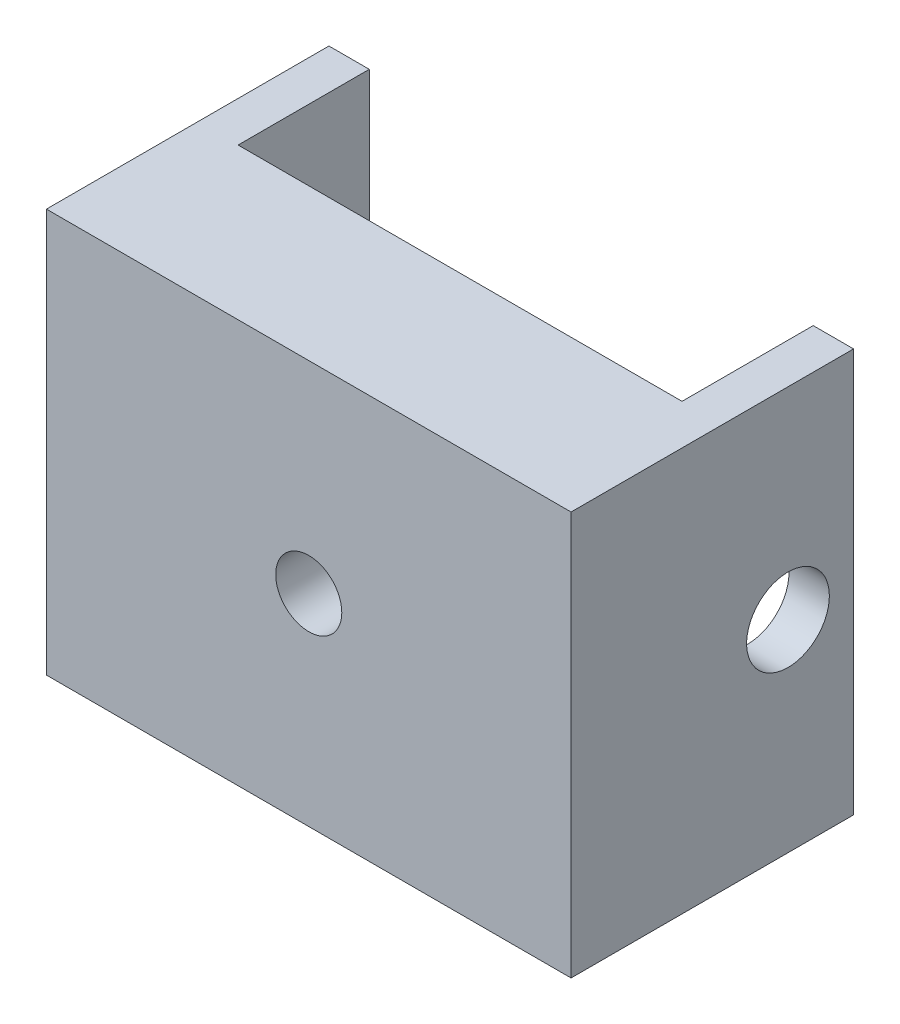
ISO-10303-21;
HEADER;
FILE_DESCRIPTION(('STEP AP214'),'2;1');
FILE_NAME('part.step','',(''),(''),'','','');
FILE_SCHEMA(('AUTOMOTIVE_DESIGN { 1 0 10303 214 1 1 1 1 }'));
ENDSEC;
DATA;
#1=APPLICATION_CONTEXT('core data for automotive mechanical design processes');
#2=APPLICATION_PROTOCOL_DEFINITION('international standard','automotive_design',2000,#1);
#3=PRODUCT_CONTEXT('',#1,'mechanical');
#4=PRODUCT('Part','Part','',(#3));
#5=PRODUCT_RELATED_PRODUCT_CATEGORY('part','',(#4));
#6=PRODUCT_DEFINITION_FORMATION('','',#4);
#7=PRODUCT_DEFINITION_CONTEXT('part definition',#1,'design');
#8=PRODUCT_DEFINITION('design','',#6,#7);
#9=PRODUCT_DEFINITION_SHAPE('','',#8);
#10=(LENGTH_UNIT() NAMED_UNIT(*) SI_UNIT(.MILLI.,.METRE.));
#11=(NAMED_UNIT(*) PLANE_ANGLE_UNIT() SI_UNIT($,.RADIAN.));
#12=(NAMED_UNIT(*) SI_UNIT($,.STERADIAN.) SOLID_ANGLE_UNIT());
#13=UNCERTAINTY_MEASURE_WITH_UNIT(LENGTH_MEASURE(1.E-05),#10,'distance_accuracy_value','');
#14=(GEOMETRIC_REPRESENTATION_CONTEXT(3) GLOBAL_UNCERTAINTY_ASSIGNED_CONTEXT((#13)) GLOBAL_UNIT_ASSIGNED_CONTEXT((#10,
#11,#12)) REPRESENTATION_CONTEXT('',''));
#15=CARTESIAN_POINT('',(0.,0.,0.));
#16=DIRECTION('',(0.,0.,1.));
#17=DIRECTION('',(1.,0.,0.));
#18=AXIS2_PLACEMENT_3D('',#15,#16,#17);
#19=CARTESIAN_POINT('',(0.,20.,-2.5));
#20=DIRECTION('',(0.,0.,-1.));
#21=DIRECTION('',(-1.,0.,0.));
#22=AXIS2_PLACEMENT_3D('',#19,#20,#21);
#23=PLANE('',#22);
#24=CARTESIAN_POINT('',(0.,10.,-2.5));
#25=DIRECTION('',(0.,0.,-1.));
#26=DIRECTION('',(-1.,0.,0.));
#27=AXIS2_PLACEMENT_3D('',#24,#25,#26);
#28=CIRCLE('',#27,1.6375);
#29=CARTESIAN_POINT('',(-1.6375,10.,-2.5));
#30=VERTEX_POINT('',#29);
#31=EDGE_CURVE('E147',#30,#30,#28,.T.);
#32=ORIENTED_EDGE('',*,*,#31,.F.);
#33=EDGE_LOOP('',(#32));
#34=FACE_BOUND('',#33,.T.);
#35=DIRECTION('',(1.,0.,0.));
#36=VECTOR('',#35,1.);
#37=CARTESIAN_POINT('',(0.,0.,-2.5));
#38=LINE('',#37,#36);
#39=CARTESIAN_POINT('',(-11.,0.,-2.5));
#40=VERTEX_POINT('',#39);
#41=CARTESIAN_POINT('',(11.,0.,-2.5));
#42=VERTEX_POINT('',#41);
#43=EDGE_CURVE('E143',#40,#42,#38,.T.);
#44=ORIENTED_EDGE('',*,*,#43,.F.);
#45=DIRECTION('',(0.,-1.,0.));
#46=VECTOR('',#45,1.);
#47=CARTESIAN_POINT('',(-11.,20.,-2.5));
#48=LINE('',#47,#46);
#49=CARTESIAN_POINT('',(-11.,20.,-2.5));
#50=VERTEX_POINT('',#49);
#51=EDGE_CURVE('E11',#50,#40,#48,.T.);
#52=ORIENTED_EDGE('',*,*,#51,.F.);
#53=DIRECTION('',(1.,0.,0.));
#54=VECTOR('',#53,1.);
#55=CARTESIAN_POINT('',(0.,20.,-2.5));
#56=LINE('',#55,#54);
#57=CARTESIAN_POINT('',(11.,20.,-2.5));
#58=VERTEX_POINT('',#57);
#59=EDGE_CURVE('E172',#50,#58,#56,.T.);
#60=ORIENTED_EDGE('',*,*,#59,.T.);
#61=DIRECTION('',(0.,-1.,0.));
#62=VECTOR('',#61,1.);
#63=CARTESIAN_POINT('',(11.,20.,-2.5));
#64=LINE('',#63,#62);
#65=EDGE_CURVE('E62',#58,#42,#64,.T.);
#66=ORIENTED_EDGE('',*,*,#65,.T.);
#67=EDGE_LOOP('',(#44,#52,#60,#66));
#68=FACE_BOUND('',#67,.T.);
#69=ADVANCED_FACE('F44',(#34,#68),#23,.T.);
#70=CARTESIAN_POINT('',(-11.,20.,0.));
#71=DIRECTION('',(1.,0.,0.));
#72=DIRECTION('',(0.,0.,-1.));
#73=AXIS2_PLACEMENT_3D('',#70,#71,#72);
#74=PLANE('',#73);
#75=CARTESIAN_POINT('',(-11.,10.,-5.75));
#76=DIRECTION('',(1.,0.,0.));
#77=DIRECTION('',(0.,0.,-1.));
#78=AXIS2_PLACEMENT_3D('',#75,#76,#77);
#79=CIRCLE('',#78,2.05);
#80=CARTESIAN_POINT('',(-11.,10.,-7.8));
#81=VERTEX_POINT('',#80);
#82=EDGE_CURVE('E242',#81,#81,#79,.T.);
#83=ORIENTED_EDGE('',*,*,#82,.F.);
#84=EDGE_LOOP('',(#83));
#85=FACE_BOUND('',#84,.T.);
#86=DIRECTION('',(0.,0.,1.));
#87=VECTOR('',#86,1.);
#88=CARTESIAN_POINT('',(-11.,0.,0.));
#89=LINE('',#88,#87);
#90=CARTESIAN_POINT('',(-11.,0.,-9.));
#91=VERTEX_POINT('',#90);
#92=EDGE_CURVE('E146',#91,#40,#89,.T.);
#93=ORIENTED_EDGE('',*,*,#92,.F.);
#94=DIRECTION('',(0.,-1.,0.));
#95=VECTOR('',#94,1.);
#96=CARTESIAN_POINT('',(-11.,20.,-9.));
#97=LINE('',#96,#95);
#98=CARTESIAN_POINT('',(-11.,20.,-9.));
#99=VERTEX_POINT('',#98);
#100=EDGE_CURVE('E54',#99,#91,#97,.T.);
#101=ORIENTED_EDGE('',*,*,#100,.F.);
#102=DIRECTION('',(0.,0.,1.));
#103=VECTOR('',#102,1.);
#104=CARTESIAN_POINT('',(-11.,20.,0.));
#105=LINE('',#104,#103);
#106=EDGE_CURVE('E205',#99,#50,#105,.T.);
#107=ORIENTED_EDGE('',*,*,#106,.T.);
#108=ORIENTED_EDGE('',*,*,#51,.T.);
#109=EDGE_LOOP('',(#93,#101,#107,#108));
#110=FACE_BOUND('',#109,.T.);
#111=ADVANCED_FACE('F196',(#85,#110),#74,.T.);
#112=CARTESIAN_POINT('',(0.,20.,-9.));
#113=DIRECTION('',(0.,0.,-1.));
#114=DIRECTION('',(-1.,0.,0.));
#115=AXIS2_PLACEMENT_3D('',#112,#113,#114);
#116=PLANE('',#115);
#117=DIRECTION('',(1.,0.,0.));
#118=VECTOR('',#117,1.);
#119=CARTESIAN_POINT('',(0.,0.,-9.));
#120=LINE('',#119,#118);
#121=CARTESIAN_POINT('',(-13.,0.,-9.));
#122=VERTEX_POINT('',#121);
#123=EDGE_CURVE('E151',#122,#91,#120,.T.);
#124=ORIENTED_EDGE('',*,*,#123,.F.);
#125=DIRECTION('',(0.,-1.,0.));
#126=VECTOR('',#125,1.);
#127=CARTESIAN_POINT('',(-13.,20.,-9.));
#128=LINE('',#127,#126);
#129=CARTESIAN_POINT('',(-13.,20.,-9.));
#130=VERTEX_POINT('',#129);
#131=EDGE_CURVE('E182',#130,#122,#128,.T.);
#132=ORIENTED_EDGE('',*,*,#131,.F.);
#133=DIRECTION('',(1.,0.,0.));
#134=VECTOR('',#133,1.);
#135=CARTESIAN_POINT('',(0.,20.,-9.));
#136=LINE('',#135,#134);
#137=EDGE_CURVE('E192',#130,#99,#136,.T.);
#138=ORIENTED_EDGE('',*,*,#137,.T.);
#139=ORIENTED_EDGE('',*,*,#100,.T.);
#140=EDGE_LOOP('',(#124,#132,#138,#139));
#141=FACE_BOUND('',#140,.T.);
#142=ADVANCED_FACE('F190',(#141),#116,.T.);
#143=CARTESIAN_POINT('',(-13.,20.,0.));
#144=DIRECTION('',(-1.,0.,0.));
#145=DIRECTION('',(0.,0.,1.));
#146=AXIS2_PLACEMENT_3D('',#143,#144,#145);
#147=PLANE('',#146);
#148=CARTESIAN_POINT('',(-13.,10.,-5.75));
#149=DIRECTION('',(1.,0.,0.));
#150=DIRECTION('',(0.,0.,-1.));
#151=AXIS2_PLACEMENT_3D('',#148,#149,#150);
#152=CIRCLE('',#151,2.05);
#153=CARTESIAN_POINT('',(-13.,10.,-7.8));
#154=VERTEX_POINT('',#153);
#155=EDGE_CURVE('E249',#154,#154,#152,.T.);
#156=ORIENTED_EDGE('',*,*,#155,.T.);
#157=EDGE_LOOP('',(#156));
#158=FACE_BOUND('',#157,.T.);
#159=DIRECTION('',(0.,0.,-1.));
#160=VECTOR('',#159,1.);
#161=CARTESIAN_POINT('',(-13.,0.,0.));
#162=LINE('',#161,#160);
#163=CARTESIAN_POINT('',(-13.,0.,5.));
#164=VERTEX_POINT('',#163);
#165=EDGE_CURVE('E155',#164,#122,#162,.T.);
#166=ORIENTED_EDGE('',*,*,#165,.F.);
#167=DIRECTION('',(0.,-1.,0.));
#168=VECTOR('',#167,1.);
#169=CARTESIAN_POINT('',(-13.,20.,5.));
#170=LINE('',#169,#168);
#171=CARTESIAN_POINT('',(-13.,20.,5.));
#172=VERTEX_POINT('',#171);
#173=EDGE_CURVE('E179',#172,#164,#170,.T.);
#174=ORIENTED_EDGE('',*,*,#173,.F.);
#175=DIRECTION('',(0.,0.,-1.));
#176=VECTOR('',#175,1.);
#177=CARTESIAN_POINT('',(-13.,20.,0.));
#178=LINE('',#177,#176);
#179=EDGE_CURVE('E204',#172,#130,#178,.T.);
#180=ORIENTED_EDGE('',*,*,#179,.T.);
#181=ORIENTED_EDGE('',*,*,#131,.T.);
#182=EDGE_LOOP('',(#166,#174,#180,#181));
#183=FACE_BOUND('',#182,.T.);
#184=ADVANCED_FACE('F202',(#158,#183),#147,.T.);
#185=CARTESIAN_POINT('',(0.,20.,5.));
#186=DIRECTION('',(0.,0.,1.));
#187=DIRECTION('',(1.,0.,0.));
#188=AXIS2_PLACEMENT_3D('',#185,#186,#187);
#189=PLANE('',#188);
#190=CARTESIAN_POINT('',(0.,10.,5.));
#191=DIRECTION('',(0.,0.,1.));
#192=DIRECTION('',(1.,0.,0.));
#193=AXIS2_PLACEMENT_3D('',#190,#191,#192);
#194=CIRCLE('',#193,1.6375);
#195=CARTESIAN_POINT('',(1.6375,10.,5.));
#196=VERTEX_POINT('',#195);
#197=EDGE_CURVE('E238',#196,#196,#194,.T.);
#198=ORIENTED_EDGE('',*,*,#197,.F.);
#199=EDGE_LOOP('',(#198));
#200=FACE_BOUND('',#199,.T.);
#201=DIRECTION('',(-1.,0.,0.));
#202=VECTOR('',#201,1.);
#203=CARTESIAN_POINT('',(0.,0.,5.));
#204=LINE('',#203,#202);
#205=CARTESIAN_POINT('',(13.,0.,5.));
#206=VERTEX_POINT('',#205);
#207=EDGE_CURVE('E159',#206,#164,#204,.T.);
#208=ORIENTED_EDGE('',*,*,#207,.F.);
#209=DIRECTION('',(0.,-1.,0.));
#210=VECTOR('',#209,1.);
#211=CARTESIAN_POINT('',(13.,20.,5.));
#212=LINE('',#211,#210);
#213=CARTESIAN_POINT('',(13.,20.,5.));
#214=VERTEX_POINT('',#213);
#215=EDGE_CURVE('E133',#214,#206,#212,.T.);
#216=ORIENTED_EDGE('',*,*,#215,.F.);
#217=DIRECTION('',(-1.,0.,0.));
#218=VECTOR('',#217,1.);
#219=CARTESIAN_POINT('',(0.,20.,5.));
#220=LINE('',#219,#218);
#221=EDGE_CURVE('E121',#214,#172,#220,.T.);
#222=ORIENTED_EDGE('',*,*,#221,.T.);
#223=ORIENTED_EDGE('',*,*,#173,.T.);
#224=EDGE_LOOP('',(#208,#216,#222,#223));
#225=FACE_BOUND('',#224,.T.);
#226=ADVANCED_FACE('F215',(#200,#225),#189,.T.);
#227=CARTESIAN_POINT('',(13.,20.,0.));
#228=DIRECTION('',(-1.,0.,0.));
#229=DIRECTION('',(0.,0.,1.));
#230=AXIS2_PLACEMENT_3D('',#227,#228,#229);
#231=PLANE('',#230);
#232=CARTESIAN_POINT('',(13.,10.,-5.75));
#233=DIRECTION('',(1.,0.,0.));
#234=DIRECTION('',(0.,0.,-1.));
#235=AXIS2_PLACEMENT_3D('',#232,#233,#234);
#236=CIRCLE('',#235,2.05);
#237=CARTESIAN_POINT('',(13.,10.,-7.8));
#238=VERTEX_POINT('',#237);
#239=EDGE_CURVE('E253',#238,#238,#236,.T.);
#240=ORIENTED_EDGE('',*,*,#239,.F.);
#241=EDGE_LOOP('',(#240));
#242=FACE_BOUND('',#241,.T.);
#243=DIRECTION('',(0.,0.,-1.));
#244=VECTOR('',#243,1.);
#245=CARTESIAN_POINT('',(13.,0.,0.));
#246=LINE('',#245,#244);
#247=CARTESIAN_POINT('',(13.,0.,-9.));
#248=VERTEX_POINT('',#247);
#249=EDGE_CURVE('E129',#206,#248,#246,.T.);
#250=ORIENTED_EDGE('',*,*,#249,.T.);
#251=DIRECTION('',(0.,-1.,0.));
#252=VECTOR('',#251,1.);
#253=CARTESIAN_POINT('',(13.,20.,-9.));
#254=LINE('',#253,#252);
#255=CARTESIAN_POINT('',(13.,20.,-9.));
#256=VERTEX_POINT('',#255);
#257=EDGE_CURVE('E126',#256,#248,#254,.T.);
#258=ORIENTED_EDGE('',*,*,#257,.F.);
#259=DIRECTION('',(0.,0.,-1.));
#260=VECTOR('',#259,1.);
#261=CARTESIAN_POINT('',(13.,20.,0.));
#262=LINE('',#261,#260);
#263=EDGE_CURVE('E113',#214,#256,#262,.T.);
#264=ORIENTED_EDGE('',*,*,#263,.F.);
#265=ORIENTED_EDGE('',*,*,#215,.T.);
#266=EDGE_LOOP('',(#250,#258,#264,#265));
#267=FACE_BOUND('',#266,.T.);
#268=ADVANCED_FACE('F127',(#242,#267),#231,.F.);
#269=CARTESIAN_POINT('',(0.,20.,-9.));
#270=DIRECTION('',(0.,0.,1.));
#271=DIRECTION('',(1.,0.,0.));
#272=AXIS2_PLACEMENT_3D('',#269,#270,#271);
#273=PLANE('',#272);
#274=DIRECTION('',(-1.,0.,0.));
#275=VECTOR('',#274,1.);
#276=CARTESIAN_POINT('',(0.,0.,-9.));
#277=LINE('',#276,#275);
#278=CARTESIAN_POINT('',(11.,0.,-9.));
#279=VERTEX_POINT('',#278);
#280=EDGE_CURVE('E165',#248,#279,#277,.T.);
#281=ORIENTED_EDGE('',*,*,#280,.T.);
#282=DIRECTION('',(0.,-1.,0.));
#283=VECTOR('',#282,1.);
#284=CARTESIAN_POINT('',(11.,20.,-9.));
#285=LINE('',#284,#283);
#286=CARTESIAN_POINT('',(11.,20.,-9.));
#287=VERTEX_POINT('',#286);
#288=EDGE_CURVE('E88',#287,#279,#285,.T.);
#289=ORIENTED_EDGE('',*,*,#288,.F.);
#290=DIRECTION('',(-1.,0.,0.));
#291=VECTOR('',#290,1.);
#292=CARTESIAN_POINT('',(0.,20.,-9.));
#293=LINE('',#292,#291);
#294=EDGE_CURVE('E118',#256,#287,#293,.T.);
#295=ORIENTED_EDGE('',*,*,#294,.F.);
#296=ORIENTED_EDGE('',*,*,#257,.T.);
#297=EDGE_LOOP('',(#281,#289,#295,#296));
#298=FACE_BOUND('',#297,.T.);
#299=ADVANCED_FACE('F135',(#298),#273,.F.);
#300=CARTESIAN_POINT('',(11.,20.,0.));
#301=DIRECTION('',(-1.,0.,0.));
#302=DIRECTION('',(0.,0.,1.));
#303=AXIS2_PLACEMENT_3D('',#300,#301,#302);
#304=PLANE('',#303);
#305=CARTESIAN_POINT('',(11.,10.,-5.75));
#306=DIRECTION('',(-1.,0.,0.));
#307=DIRECTION('',(0.,0.,1.));
#308=AXIS2_PLACEMENT_3D('',#305,#306,#307);
#309=CIRCLE('',#308,2.05);
#310=CARTESIAN_POINT('',(11.,10.,-3.7));
#311=VERTEX_POINT('',#310);
#312=EDGE_CURVE('E47',#311,#311,#309,.T.);
#313=ORIENTED_EDGE('',*,*,#312,.F.);
#314=EDGE_LOOP('',(#313));
#315=FACE_BOUND('',#314,.T.);
#316=DIRECTION('',(0.,0.,-1.));
#317=VECTOR('',#316,1.);
#318=CARTESIAN_POINT('',(11.,0.,0.));
#319=LINE('',#318,#317);
#320=EDGE_CURVE('E168',#42,#279,#319,.T.);
#321=ORIENTED_EDGE('',*,*,#320,.F.);
#322=ORIENTED_EDGE('',*,*,#65,.F.);
#323=DIRECTION('',(0.,0.,-1.));
#324=VECTOR('',#323,1.);
#325=CARTESIAN_POINT('',(11.,20.,0.));
#326=LINE('',#325,#324);
#327=EDGE_CURVE('E137',#58,#287,#326,.T.);
#328=ORIENTED_EDGE('',*,*,#327,.T.);
#329=ORIENTED_EDGE('',*,*,#288,.T.);
#330=EDGE_LOOP('',(#321,#322,#328,#329));
#331=FACE_BOUND('',#330,.T.);
#332=ADVANCED_FACE('F216',(#315,#331),#304,.T.);
#333=CARTESIAN_POINT('',(0.,20.,0.));
#334=DIRECTION('',(0.,1.,0.));
#335=DIRECTION('',(0.,0.,1.));
#336=AXIS2_PLACEMENT_3D('',#333,#334,#335);
#337=PLANE('',#336);
#338=ORIENTED_EDGE('',*,*,#59,.F.);
#339=ORIENTED_EDGE('',*,*,#106,.F.);
#340=ORIENTED_EDGE('',*,*,#137,.F.);
#341=ORIENTED_EDGE('',*,*,#179,.F.);
#342=ORIENTED_EDGE('',*,*,#221,.F.);
#343=ORIENTED_EDGE('',*,*,#263,.T.);
#344=ORIENTED_EDGE('',*,*,#294,.T.);
#345=ORIENTED_EDGE('',*,*,#327,.F.);
#346=EDGE_LOOP('',(#338,#339,#340,#341,#342,#343,#344,#345));
#347=FACE_BOUND('',#346,.T.);
#348=ADVANCED_FACE('F115',(#347),#337,.T.);
#349=CARTESIAN_POINT('',(0.,0.,0.));
#350=DIRECTION('',(0.,1.,0.));
#351=DIRECTION('',(0.,0.,1.));
#352=AXIS2_PLACEMENT_3D('',#349,#350,#351);
#353=PLANE('',#352);
#354=ORIENTED_EDGE('',*,*,#43,.T.);
#355=ORIENTED_EDGE('',*,*,#320,.T.);
#356=ORIENTED_EDGE('',*,*,#280,.F.);
#357=ORIENTED_EDGE('',*,*,#249,.F.);
#358=ORIENTED_EDGE('',*,*,#207,.T.);
#359=ORIENTED_EDGE('',*,*,#165,.T.);
#360=ORIENTED_EDGE('',*,*,#123,.T.);
#361=ORIENTED_EDGE('',*,*,#92,.T.);
#362=EDGE_LOOP('',(#354,#355,#356,#357,#358,#359,#360,#361));
#363=FACE_BOUND('',#362,.T.);
#364=ADVANCED_FACE('F198',(#363),#353,.F.);
#365=CARTESIAN_POINT('',(0.,10.,-9.));
#366=DIRECTION('',(0.,0.,1.));
#367=DIRECTION('',(1.,0.,0.));
#368=AXIS2_PLACEMENT_3D('',#365,#366,#367);
#369=CYLINDRICAL_SURFACE('',#368,1.6375);
#370=ORIENTED_EDGE('',*,*,#31,.T.);
#371=EDGE_LOOP('',(#370));
#372=FACE_BOUND('',#371,.T.);
#373=ORIENTED_EDGE('',*,*,#197,.T.);
#374=EDGE_LOOP('',(#373));
#375=FACE_BOUND('',#374,.T.);
#376=ADVANCED_FACE('F295',(#372,#375),#369,.F.);
#377=CARTESIAN_POINT('',(-13.,10.,-5.75));
#378=DIRECTION('',(1.,0.,0.));
#379=DIRECTION('',(0.,0.,-1.));
#380=AXIS2_PLACEMENT_3D('',#377,#378,#379);
#381=CYLINDRICAL_SURFACE('',#380,2.05);
#382=ORIENTED_EDGE('',*,*,#312,.T.);
#383=EDGE_LOOP('',(#382));
#384=FACE_BOUND('',#383,.T.);
#385=ORIENTED_EDGE('',*,*,#239,.T.);
#386=EDGE_LOOP('',(#385));
#387=FACE_BOUND('',#386,.T.);
#388=ADVANCED_FACE('F258',(#384,#387),#381,.F.);
#389=ORIENTED_EDGE('',*,*,#82,.T.);
#390=EDGE_LOOP('',(#389));
#391=FACE_BOUND('',#390,.T.);
#392=ORIENTED_EDGE('',*,*,#155,.F.);
#393=EDGE_LOOP('',(#392));
#394=FACE_BOUND('',#393,.T.);
#395=ADVANCED_FACE('F364',(#391,#394),#381,.F.);
#396=CLOSED_SHELL('',(#69,#111,#142,#184,#226,#268,#299,#332,#348,#364,#376,#388,#395));
#397=MANIFOLD_SOLID_BREP('B2',#396);
#398=ADVANCED_BREP_SHAPE_REPRESENTATION('',(#18,#397),#14);
#399=SHAPE_DEFINITION_REPRESENTATION(#9,#398);
ENDSEC;
END-ISO-10303-21;
